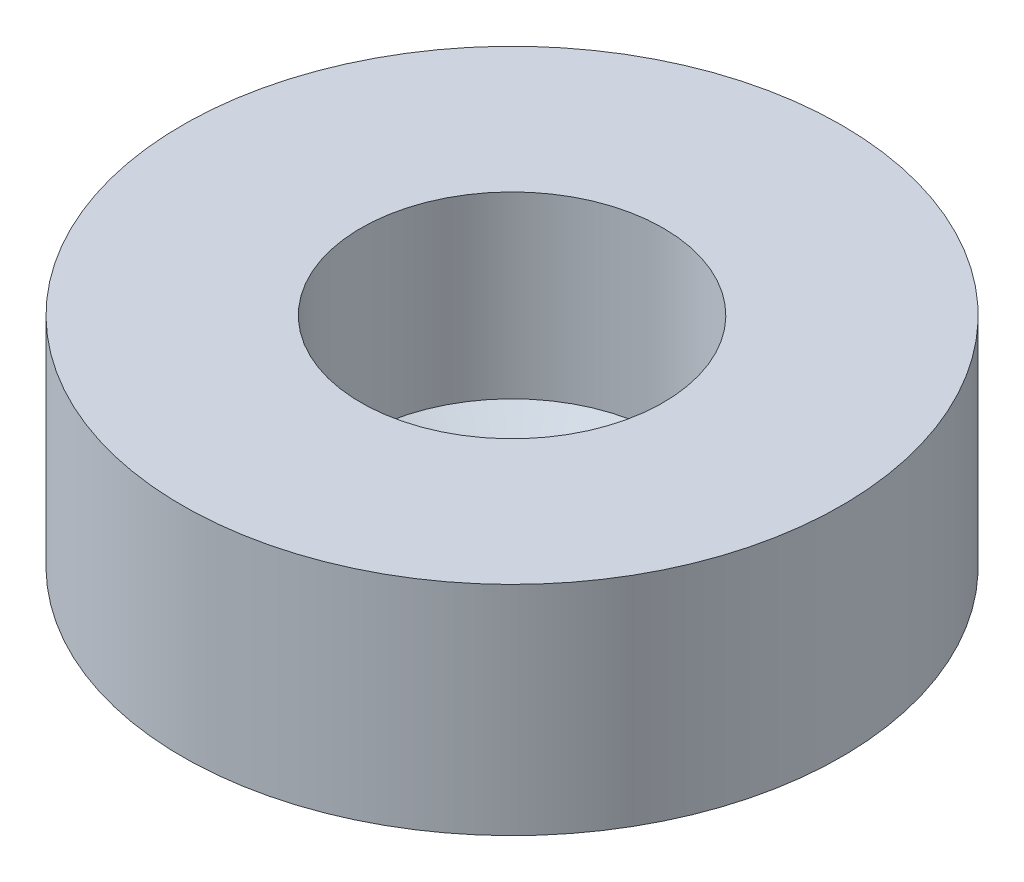
ISO-10303-21;
HEADER;
FILE_DESCRIPTION(('STEP AP214'),'2;1');
FILE_NAME('part.step','',(''),(''),'','','');
FILE_SCHEMA(('AUTOMOTIVE_DESIGN { 1 0 10303 214 1 1 1 1 }'));
ENDSEC;
DATA;
#1=APPLICATION_CONTEXT('core data for automotive mechanical design processes');
#2=APPLICATION_PROTOCOL_DEFINITION('international standard','automotive_design',2000,#1);
#3=PRODUCT_CONTEXT('',#1,'mechanical');
#4=PRODUCT('Part','Part','',(#3));
#5=PRODUCT_RELATED_PRODUCT_CATEGORY('part','',(#4));
#6=PRODUCT_DEFINITION_FORMATION('','',#4);
#7=PRODUCT_DEFINITION_CONTEXT('part definition',#1,'design');
#8=PRODUCT_DEFINITION('design','',#6,#7);
#9=PRODUCT_DEFINITION_SHAPE('','',#8);
#10=(LENGTH_UNIT() NAMED_UNIT(*) SI_UNIT(.MILLI.,.METRE.));
#11=(NAMED_UNIT(*) PLANE_ANGLE_UNIT() SI_UNIT($,.RADIAN.));
#12=(NAMED_UNIT(*) SI_UNIT($,.STERADIAN.) SOLID_ANGLE_UNIT());
#13=UNCERTAINTY_MEASURE_WITH_UNIT(LENGTH_MEASURE(1.E-05),#10,'distance_accuracy_value','');
#14=(GEOMETRIC_REPRESENTATION_CONTEXT(3) GLOBAL_UNCERTAINTY_ASSIGNED_CONTEXT((#13)) GLOBAL_UNIT_ASSIGNED_CONTEXT((#10,
#11,#12)) REPRESENTATION_CONTEXT('',''));
#15=CARTESIAN_POINT('',(0.,0.,0.));
#16=DIRECTION('',(0.,0.,1.));
#17=DIRECTION('',(1.,0.,0.));
#18=AXIS2_PLACEMENT_3D('',#15,#16,#17);
#19=CARTESIAN_POINT('',(-6.5405,0.,0.));
#20=DIRECTION('',(0.,1.,0.));
#21=DIRECTION('',(0.,0.,1.));
#22=AXIS2_PLACEMENT_3D('',#19,#20,#21);
#23=PLANE('',#22);
#24=CARTESIAN_POINT('',(0.,0.,0.));
#25=DIRECTION('',(0.,-1.,0.));
#26=DIRECTION('',(0.,0.,-1.));
#27=AXIS2_PLACEMENT_3D('',#24,#25,#26);
#28=CIRCLE('',#27,1.73181913044889);
#29=CARTESIAN_POINT('',(0.,0.,-1.73181913044889));
#30=VERTEX_POINT('',#29);
#31=EDGE_CURVE('E10',#30,#30,#28,.T.);
#32=ORIENTED_EDGE('',*,*,#31,.F.);
#33=EDGE_LOOP('',(#32));
#34=FACE_BOUND('',#33,.T.);
#35=CARTESIAN_POINT('',(0.,0.,0.));
#36=DIRECTION('',(0.,-1.,0.));
#37=DIRECTION('',(0.,0.,-1.));
#38=AXIS2_PLACEMENT_3D('',#35,#36,#37);
#39=CIRCLE('',#38,6.5405);
#40=CARTESIAN_POINT('',(0.,0.,-6.5405));
#41=VERTEX_POINT('',#40);
#42=EDGE_CURVE('E50',#41,#41,#39,.T.);
#43=ORIENTED_EDGE('',*,*,#42,.T.);
#44=EDGE_LOOP('',(#43));
#45=FACE_BOUND('',#44,.T.);
#46=ADVANCED_FACE('F31',(#34,#45),#23,.F.);
#47=CARTESIAN_POINT('',(0.,0.,0.));
#48=DIRECTION('',(0.,1.,0.));
#49=DIRECTION('',(0.,0.,1.));
#50=AXIS2_PLACEMENT_3D('',#47,#48,#49);
#51=CONICAL_SURFACE('',#50,1.73181913044889,1.02974425867666);
#52=CARTESIAN_POINT('',(0.,0.762,0.));
#53=DIRECTION('',(0.,-1.,0.));
#54=DIRECTION('',(0.,0.,-1.));
#55=AXIS2_PLACEMENT_3D('',#52,#53,#54);
#56=CIRCLE('',#55,3.000000096);
#57=CARTESIAN_POINT('',(0.,0.762,-3.000000096));
#58=VERTEX_POINT('',#57);
#59=EDGE_CURVE('E37',#58,#58,#56,.T.);
#60=ORIENTED_EDGE('',*,*,#59,.F.);
#61=EDGE_LOOP('',(#60));
#62=FACE_BOUND('',#61,.T.);
#63=ORIENTED_EDGE('',*,*,#31,.T.);
#64=EDGE_LOOP('',(#63));
#65=FACE_BOUND('',#64,.T.);
#66=ADVANCED_FACE('F69',(#62,#65),#51,.F.);
#67=CARTESIAN_POINT('',(0.,0.,0.));
#68=DIRECTION('',(0.,-1.,0.));
#69=DIRECTION('',(0.,0.,-1.));
#70=AXIS2_PLACEMENT_3D('',#67,#68,#69);
#71=CYLINDRICAL_SURFACE('',#70,3.000000096);
#72=CARTESIAN_POINT('',(0.,4.318,0.));
#73=DIRECTION('',(0.,-1.,0.));
#74=DIRECTION('',(0.,0.,-1.));
#75=AXIS2_PLACEMENT_3D('',#72,#73,#74);
#76=CIRCLE('',#75,3.000000096);
#77=CARTESIAN_POINT('',(0.,4.318,-3.000000096));
#78=VERTEX_POINT('',#77);
#79=EDGE_CURVE('E41',#78,#78,#76,.T.);
#80=ORIENTED_EDGE('',*,*,#79,.F.);
#81=EDGE_LOOP('',(#80));
#82=FACE_BOUND('',#81,.T.);
#83=ORIENTED_EDGE('',*,*,#59,.T.);
#84=EDGE_LOOP('',(#83));
#85=FACE_BOUND('',#84,.T.);
#86=ADVANCED_FACE('F64',(#82,#85),#71,.F.);
#87=CARTESIAN_POINT('',(-3.000000096,4.318,0.));
#88=DIRECTION('',(0.,-1.,0.));
#89=DIRECTION('',(0.,0.,-1.));
#90=AXIS2_PLACEMENT_3D('',#87,#88,#89);
#91=PLANE('',#90);
#92=CARTESIAN_POINT('',(0.,4.318,0.));
#93=DIRECTION('',(0.,-1.,0.));
#94=DIRECTION('',(0.,0.,-1.));
#95=AXIS2_PLACEMENT_3D('',#92,#93,#94);
#96=CIRCLE('',#95,6.5405);
#97=CARTESIAN_POINT('',(0.,4.318,-6.5405));
#98=VERTEX_POINT('',#97);
#99=EDGE_CURVE('E45',#98,#98,#96,.T.);
#100=ORIENTED_EDGE('',*,*,#99,.F.);
#101=EDGE_LOOP('',(#100));
#102=FACE_BOUND('',#101,.T.);
#103=ORIENTED_EDGE('',*,*,#79,.T.);
#104=EDGE_LOOP('',(#103));
#105=FACE_BOUND('',#104,.T.);
#106=ADVANCED_FACE('F58',(#102,#105),#91,.F.);
#107=CARTESIAN_POINT('',(0.,0.,0.));
#108=DIRECTION('',(0.,-1.,0.));
#109=DIRECTION('',(0.,0.,-1.));
#110=AXIS2_PLACEMENT_3D('',#107,#108,#109);
#111=CYLINDRICAL_SURFACE('',#110,6.5405);
#112=ORIENTED_EDGE('',*,*,#42,.F.);
#113=EDGE_LOOP('',(#112));
#114=FACE_BOUND('',#113,.T.);
#115=ORIENTED_EDGE('',*,*,#99,.T.);
#116=EDGE_LOOP('',(#115));
#117=FACE_BOUND('',#116,.T.);
#118=ADVANCED_FACE('F55',(#114,#117),#111,.T.);
#119=CLOSED_SHELL('',(#46,#66,#86,#106,#118));
#120=MANIFOLD_SOLID_BREP('B2',#119);
#121=ADVANCED_BREP_SHAPE_REPRESENTATION('',(#18,#120),#14);
#122=SHAPE_DEFINITION_REPRESENTATION(#9,#121);
ENDSEC;
END-ISO-10303-21;
